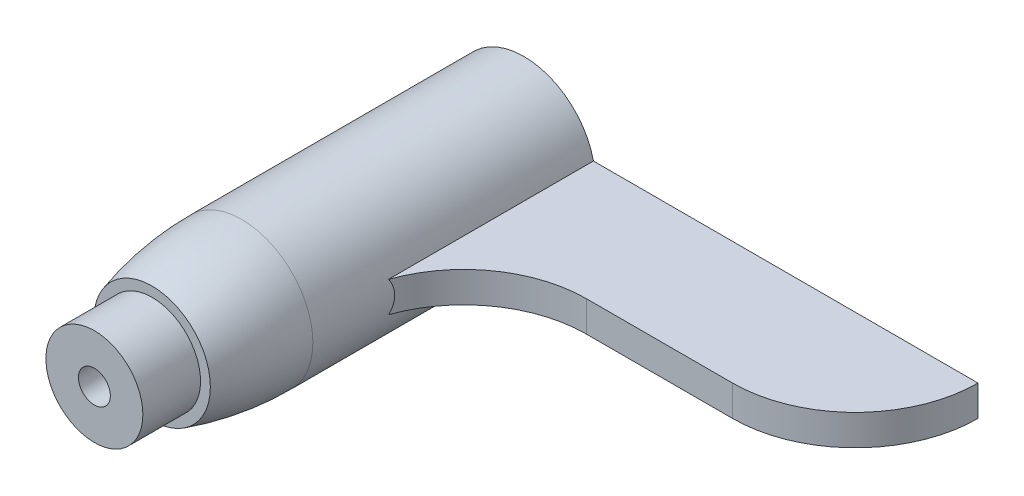
ISO-10303-21;
HEADER;
FILE_DESCRIPTION(('STEP AP214'),'2;1');
FILE_NAME('part.step','',(''),(''),'','','');
FILE_SCHEMA(('AUTOMOTIVE_DESIGN { 1 0 10303 214 1 1 1 1 }'));
ENDSEC;
DATA;
#1=APPLICATION_CONTEXT('core data for automotive mechanical design processes');
#2=APPLICATION_PROTOCOL_DEFINITION('international standard','automotive_design',2000,#1);
#3=PRODUCT_CONTEXT('',#1,'mechanical');
#4=PRODUCT('Part','Part','',(#3));
#5=PRODUCT_RELATED_PRODUCT_CATEGORY('part','',(#4));
#6=PRODUCT_DEFINITION_FORMATION('','',#4);
#7=PRODUCT_DEFINITION_CONTEXT('part definition',#1,'design');
#8=PRODUCT_DEFINITION('design','',#6,#7);
#9=PRODUCT_DEFINITION_SHAPE('','',#8);
#10=(LENGTH_UNIT() NAMED_UNIT(*) SI_UNIT(.MILLI.,.METRE.));
#11=(NAMED_UNIT(*) PLANE_ANGLE_UNIT() SI_UNIT($,.RADIAN.));
#12=(NAMED_UNIT(*) SI_UNIT($,.STERADIAN.) SOLID_ANGLE_UNIT());
#13=UNCERTAINTY_MEASURE_WITH_UNIT(LENGTH_MEASURE(1.E-05),#10,'distance_accuracy_value','');
#14=(GEOMETRIC_REPRESENTATION_CONTEXT(3) GLOBAL_UNCERTAINTY_ASSIGNED_CONTEXT((#13)) GLOBAL_UNIT_ASSIGNED_CONTEXT((#10,
#11,#12)) REPRESENTATION_CONTEXT('',''));
#15=CARTESIAN_POINT('',(0.,0.,0.));
#16=DIRECTION('',(0.,0.,1.));
#17=DIRECTION('',(1.,0.,0.));
#18=AXIS2_PLACEMENT_3D('',#15,#16,#17);
#19=CARTESIAN_POINT('',(0.,0.,23.));
#20=DIRECTION('',(0.,0.,-1.));
#21=DIRECTION('',(-1.,0.,0.));
#22=AXIS2_PLACEMENT_3D('',#19,#20,#21);
#23=CYLINDRICAL_SURFACE('',#22,5.8);
#24=CARTESIAN_POINT('',(0.,0.,23.));
#25=DIRECTION('',(0.,0.,1.));
#26=DIRECTION('',(1.,0.,0.));
#27=AXIS2_PLACEMENT_3D('',#24,#25,#26);
#28=CIRCLE('',#27,5.8);
#29=CARTESIAN_POINT('',(5.8,0.,23.));
#30=VERTEX_POINT('',#29);
#31=EDGE_CURVE('E45',#30,#30,#28,.T.);
#32=ORIENTED_EDGE('',*,*,#31,.F.);
#33=EDGE_LOOP('',(#32));
#34=FACE_BOUND('',#33,.T.);
#35=DIRECTION('',(0.,0.,-1.));
#36=VECTOR('',#35,1.);
#37=CARTESIAN_POINT('',(5.66370020393029,1.25,23.));
#38=LINE('',#37,#36);
#39=CARTESIAN_POINT('',(5.66370020393029,1.25,0.));
#40=VERTEX_POINT('',#39);
#41=CARTESIAN_POINT('',(5.66370020393029,1.25,16.6943581195537));
#42=VERTEX_POINT('',#41);
#43=EDGE_CURVE('E87',#40,#42,#38,.F.);
#44=ORIENTED_EDGE('',*,*,#43,.F.);
#45=CARTESIAN_POINT('',(0.,0.,0.));
#46=DIRECTION('',(0.,0.,1.));
#47=DIRECTION('',(1.,0.,0.));
#48=AXIS2_PLACEMENT_3D('',#45,#46,#47);
#49=CIRCLE('',#48,5.8);
#50=CARTESIAN_POINT('',(5.66370020393029,-1.25,0.));
#51=VERTEX_POINT('',#50);
#52=EDGE_CURVE('E123',#40,#51,#49,.T.);
#53=ORIENTED_EDGE('',*,*,#52,.T.);
#54=DIRECTION('',(0.,0.,-1.));
#55=VECTOR('',#54,1.);
#56=CARTESIAN_POINT('',(5.66370020393029,-1.25,23.));
#57=LINE('',#56,#55);
#58=CARTESIAN_POINT('',(5.66370020393029,-1.25,16.6943581195537));
#59=VERTEX_POINT('',#58);
#60=EDGE_CURVE('E96',#51,#59,#57,.F.);
#61=ORIENTED_EDGE('',*,*,#60,.T.);
#62=CARTESIAN_POINT('',(5.66370020393029,1.25,16.6943581195537));
#63=CARTESIAN_POINT('',(5.67527805384435,1.19754270115823,16.661302864782));
#64=CARTESIAN_POINT('',(5.68637662373565,1.1437859828789,16.6301716011866));
#65=CARTESIAN_POINT('',(5.70739227517795,1.03383434421869,16.5720223034653));
#66=CARTESIAN_POINT('',(5.71730870023423,0.977638092474154,16.5450065525639));
#67=CARTESIAN_POINT('',(5.74495451039579,0.805576723619499,16.4705204761731));
#68=CARTESIAN_POINT('',(5.76055018697844,0.68637173208329,16.429695806337));
#69=CARTESIAN_POINT('',(5.78445768861126,0.441809691570459,16.367756468644));
#70=CARTESIAN_POINT('',(5.79274453831036,0.316433081948017,16.346709367787));
#71=CARTESIAN_POINT('',(5.80102087765435,0.0638347290132216,16.3256881095753));
#72=CARTESIAN_POINT('',(5.80102493692735,-0.0633833807249769,16.3256769494961));
#73=CARTESIAN_POINT('',(5.79297169255558,-0.309811605845001,16.3461332331236));
#74=CARTESIAN_POINT('',(5.78529357690183,-0.429116918619726,16.3656374122334));
#75=CARTESIAN_POINT('',(5.7632047287075,-0.662756190260775,16.4227794964599));
#76=CARTESIAN_POINT('',(5.7487887700227,-0.777086214712757,16.4604314784575));
#77=CARTESIAN_POINT('',(5.72190068555743,-0.950778759641126,16.5325471938731));
#78=CARTESIAN_POINT('',(5.71122307619369,-1.0127828278463,16.5615181980528));
#79=CARTESIAN_POINT('',(5.6884515786713,-1.13370681953975,16.624356830675));
#80=CARTESIAN_POINT('',(5.67636278061071,-1.19263678211082,16.6582069580978));
#81=CARTESIAN_POINT('',(5.66370020393029,-1.25,16.6943581195537));
#82=B_SPLINE_CURVE_WITH_KNOTS('',3,(#62,#63,#64,#65,#66,#67,#68,#69,#70,#71,#72,#73,#74,#75,#76,
#77,#78,#79,#80,#81),.UNSPECIFIED.,.F.,.F.,(4,2,2,2,2,2,2,2,2,4),(0.,0.189141256322419,
0.37838706619023,0.757353867214392,1.1376106922534,1.51719863578914,1.87893121162049,
2.24094482871037,2.44851538325655,2.65535911767212),.UNSPECIFIED.);
#83=EDGE_CURVE('E11',#42,#59,#82,.T.);
#84=ORIENTED_EDGE('',*,*,#83,.F.);
#85=EDGE_LOOP('',(#44,#53,#61,#84));
#86=FACE_BOUND('',#85,.T.);
#87=ADVANCED_FACE('F33',(#34,#86),#23,.T.);
#88=CARTESIAN_POINT('',(0.,0.,0.));
#89=DIRECTION('',(0.,0.,1.));
#90=DIRECTION('',(1.,0.,0.));
#91=AXIS2_PLACEMENT_3D('',#88,#89,#90);
#92=PLANE('',#91);
#93=CARTESIAN_POINT('',(0.,0.,0.));
#94=DIRECTION('',(0.,0.,1.));
#95=DIRECTION('',(1.,0.,0.));
#96=AXIS2_PLACEMENT_3D('',#93,#94,#95);
#97=CIRCLE('',#96,1.3);
#98=CARTESIAN_POINT('',(1.3,0.,0.));
#99=VERTEX_POINT('',#98);
#100=EDGE_CURVE('E164',#99,#99,#97,.T.);
#101=ORIENTED_EDGE('',*,*,#100,.T.);
#102=EDGE_LOOP('',(#101));
#103=FACE_BOUND('',#102,.T.);
#104=ORIENTED_EDGE('',*,*,#52,.F.);
#105=DIRECTION('',(-1.,0.,0.));
#106=VECTOR('',#105,1.);
#107=CARTESIAN_POINT('',(0.,1.25,0.));
#108=LINE('',#107,#106);
#109=CARTESIAN_POINT('',(37.,1.25,0.));
#110=VERTEX_POINT('',#109);
#111=EDGE_CURVE('E59',#110,#40,#108,.T.);
#112=ORIENTED_EDGE('',*,*,#111,.F.);
#113=DIRECTION('',(0.,-1.,0.));
#114=VECTOR('',#113,1.);
#115=CARTESIAN_POINT('',(37.,1.25,0.));
#116=LINE('',#115,#114);
#117=CARTESIAN_POINT('',(37.,-1.25,0.));
#118=VERTEX_POINT('',#117);
#119=EDGE_CURVE('E108',#110,#118,#116,.T.);
#120=ORIENTED_EDGE('',*,*,#119,.T.);
#121=DIRECTION('',(-1.,0.,0.));
#122=VECTOR('',#121,1.);
#123=CARTESIAN_POINT('',(0.,-1.25,0.));
#124=LINE('',#123,#122);
#125=EDGE_CURVE('E90',#118,#51,#124,.T.);
#126=ORIENTED_EDGE('',*,*,#125,.T.);
#127=EDGE_LOOP('',(#104,#112,#120,#126));
#128=FACE_BOUND('',#127,.T.);
#129=ADVANCED_FACE('F129',(#103,#128),#92,.F.);
#130=CARTESIAN_POINT('',(15.1015353242447,1.25,20.));
#131=DIRECTION('',(0.,-1.,0.));
#132=DIRECTION('',(0.,0.,-1.));
#133=AXIS2_PLACEMENT_3D('',#130,#131,#132);
#134=CYLINDRICAL_SURFACE('',#133,10.);
#135=CARTESIAN_POINT('',(15.1015353242447,1.25,20.));
#136=DIRECTION('',(0.,-1.,0.));
#137=DIRECTION('',(0.,0.,1.));
#138=AXIS2_PLACEMENT_3D('',#135,#136,#137);
#139=CIRCLE('',#138,10.);
#140=CARTESIAN_POINT('',(15.1015353242447,1.25,10.));
#141=VERTEX_POINT('',#140);
#142=EDGE_CURVE('E81',#42,#141,#139,.T.);
#143=ORIENTED_EDGE('',*,*,#142,.F.);
#144=ORIENTED_EDGE('',*,*,#83,.T.);
#145=CARTESIAN_POINT('',(15.1015353242447,-1.25,20.));
#146=DIRECTION('',(0.,-1.,0.));
#147=DIRECTION('',(0.,0.,1.));
#148=AXIS2_PLACEMENT_3D('',#145,#146,#147);
#149=CIRCLE('',#148,10.);
#150=CARTESIAN_POINT('',(15.1015353242447,-1.25,10.));
#151=VERTEX_POINT('',#150);
#152=EDGE_CURVE('E52',#59,#151,#149,.T.);
#153=ORIENTED_EDGE('',*,*,#152,.T.);
#154=DIRECTION('',(0.,-1.,0.));
#155=VECTOR('',#154,1.);
#156=CARTESIAN_POINT('',(15.1015353242447,1.25,10.));
#157=LINE('',#156,#155);
#158=EDGE_CURVE('E93',#141,#151,#157,.T.);
#159=ORIENTED_EDGE('',*,*,#158,.F.);
#160=EDGE_LOOP('',(#143,#144,#153,#159));
#161=FACE_BOUND('',#160,.T.);
#162=ADVANCED_FACE('F94',(#161),#134,.F.);
#163=CARTESIAN_POINT('',(27.,1.25,0.));
#164=DIRECTION('',(0.,-1.,0.));
#165=DIRECTION('',(0.,0.,-1.));
#166=AXIS2_PLACEMENT_3D('',#163,#164,#165);
#167=PLANE('',#166);
#168=ORIENTED_EDGE('',*,*,#111,.T.);
#169=ORIENTED_EDGE('',*,*,#43,.T.);
#170=ORIENTED_EDGE('',*,*,#142,.T.);
#171=DIRECTION('',(1.,0.,0.));
#172=VECTOR('',#171,1.);
#173=CARTESIAN_POINT('',(27.,1.25,10.));
#174=LINE('',#173,#172);
#175=CARTESIAN_POINT('',(27.,1.25,10.));
#176=VERTEX_POINT('',#175);
#177=EDGE_CURVE('E85',#141,#176,#174,.T.);
#178=ORIENTED_EDGE('',*,*,#177,.T.);
#179=CARTESIAN_POINT('',(27.,1.25,0.));
#180=DIRECTION('',(0.,1.,0.));
#181=DIRECTION('',(0.,0.,-1.));
#182=AXIS2_PLACEMENT_3D('',#179,#180,#181);
#183=CIRCLE('',#182,10.);
#184=EDGE_CURVE('E102',#176,#110,#183,.T.);
#185=ORIENTED_EDGE('',*,*,#184,.T.);
#186=EDGE_LOOP('',(#168,#169,#170,#178,#185));
#187=FACE_BOUND('',#186,.T.);
#188=ADVANCED_FACE('F83',(#187),#167,.F.);
#189=CARTESIAN_POINT('',(27.,-1.25,0.));
#190=DIRECTION('',(0.,-1.,0.));
#191=DIRECTION('',(0.,0.,-1.));
#192=AXIS2_PLACEMENT_3D('',#189,#190,#191);
#193=PLANE('',#192);
#194=ORIENTED_EDGE('',*,*,#60,.F.);
#195=ORIENTED_EDGE('',*,*,#125,.F.);
#196=CARTESIAN_POINT('',(27.,-1.25,0.));
#197=DIRECTION('',(0.,1.,0.));
#198=DIRECTION('',(0.,0.,-1.));
#199=AXIS2_PLACEMENT_3D('',#196,#197,#198);
#200=CIRCLE('',#199,10.);
#201=CARTESIAN_POINT('',(27.,-1.25,10.));
#202=VERTEX_POINT('',#201);
#203=EDGE_CURVE('E113',#202,#118,#200,.T.);
#204=ORIENTED_EDGE('',*,*,#203,.F.);
#205=DIRECTION('',(1.,0.,0.));
#206=VECTOR('',#205,1.);
#207=CARTESIAN_POINT('',(27.,-1.25,10.));
#208=LINE('',#207,#206);
#209=EDGE_CURVE('E110',#151,#202,#208,.T.);
#210=ORIENTED_EDGE('',*,*,#209,.F.);
#211=ORIENTED_EDGE('',*,*,#152,.F.);
#212=EDGE_LOOP('',(#194,#195,#204,#210,#211));
#213=FACE_BOUND('',#212,.T.);
#214=ADVANCED_FACE('F133',(#213),#193,.T.);
#215=CARTESIAN_POINT('',(27.,1.25,10.));
#216=DIRECTION('',(0.,0.,-1.));
#217=DIRECTION('',(-1.,0.,0.));
#218=AXIS2_PLACEMENT_3D('',#215,#216,#217);
#219=PLANE('',#218);
#220=ORIENTED_EDGE('',*,*,#209,.T.);
#221=DIRECTION('',(0.,-1.,0.));
#222=VECTOR('',#221,1.);
#223=CARTESIAN_POINT('',(27.,1.25,10.));
#224=LINE('',#223,#222);
#225=EDGE_CURVE('E97',#176,#202,#224,.T.);
#226=ORIENTED_EDGE('',*,*,#225,.F.);
#227=ORIENTED_EDGE('',*,*,#177,.F.);
#228=ORIENTED_EDGE('',*,*,#158,.T.);
#229=EDGE_LOOP('',(#220,#226,#227,#228));
#230=FACE_BOUND('',#229,.T.);
#231=ADVANCED_FACE('F99',(#230),#219,.F.);
#232=CARTESIAN_POINT('',(27.,1.25,0.));
#233=DIRECTION('',(0.,-1.,0.));
#234=DIRECTION('',(0.,0.,-1.));
#235=AXIS2_PLACEMENT_3D('',#232,#233,#234);
#236=CYLINDRICAL_SURFACE('',#235,10.);
#237=ORIENTED_EDGE('',*,*,#203,.T.);
#238=ORIENTED_EDGE('',*,*,#119,.F.);
#239=ORIENTED_EDGE('',*,*,#184,.F.);
#240=ORIENTED_EDGE('',*,*,#225,.T.);
#241=EDGE_LOOP('',(#237,#238,#239,#240));
#242=FACE_BOUND('',#241,.T.);
#243=ADVANCED_FACE('F135',(#242),#236,.T.);
#244=CARTESIAN_POINT('',(0.,0.,23.0000000000001));
#245=DIRECTION('',(0.,0.,1.));
#246=DIRECTION('',(1.,0.,0.));
#247=AXIS2_PLACEMENT_3D('',#244,#245,#246);
#248=DEGENERATE_TOROIDAL_SURFACE('',#247,20.1011904761904,25.9011904761905,.F.);
#249=CARTESIAN_POINT('',(1.05791884566947E-13,0.,30.3));
#250=DIRECTION('',(0.,0.,1.));
#251=DIRECTION('',(1.,0.,0.));
#252=AXIS2_PLACEMENT_3D('',#249,#250,#251);
#253=CIRCLE('',#252,4.75000000000011);
#254=CARTESIAN_POINT('',(4.75000000000022,0.,30.3));
#255=VERTEX_POINT('',#254);
#256=EDGE_CURVE('E111',#255,#255,#253,.T.);
#257=ORIENTED_EDGE('',*,*,#256,.F.);
#258=EDGE_LOOP('',(#257));
#259=FACE_BOUND('',#258,.T.);
#260=ORIENTED_EDGE('',*,*,#31,.T.);
#261=EDGE_LOOP('',(#260));
#262=FACE_BOUND('',#261,.T.);
#263=ADVANCED_FACE('F137',(#259,#262),#248,.F.);
#264=CARTESIAN_POINT('',(-3.95,0.,30.3));
#265=DIRECTION('',(0.,0.,-1.));
#266=DIRECTION('',(-1.,0.,0.));
#267=AXIS2_PLACEMENT_3D('',#264,#265,#266);
#268=PLANE('',#267);
#269=CARTESIAN_POINT('',(1.05791884566947E-13,0.,30.3));
#270=DIRECTION('',(0.,0.,1.));
#271=DIRECTION('',(1.,0.,0.));
#272=AXIS2_PLACEMENT_3D('',#269,#270,#271);
#273=CIRCLE('',#272,3.95000000000011);
#274=CARTESIAN_POINT('',(3.95000000000021,0.,30.3));
#275=VERTEX_POINT('',#274);
#276=EDGE_CURVE('E170',#275,#275,#273,.T.);
#277=ORIENTED_EDGE('',*,*,#276,.F.);
#278=EDGE_LOOP('',(#277));
#279=FACE_BOUND('',#278,.T.);
#280=ORIENTED_EDGE('',*,*,#256,.T.);
#281=EDGE_LOOP('',(#280));
#282=FACE_BOUND('',#281,.T.);
#283=ADVANCED_FACE('F143',(#279,#282),#268,.F.);
#284=CARTESIAN_POINT('',(3.49148133884313E-12,0.,1000.));
#285=DIRECTION('',(0.,0.,1.));
#286=DIRECTION('',(1.,0.,0.));
#287=AXIS2_PLACEMENT_3D('',#284,#285,#286);
#288=CYLINDRICAL_SURFACE('',#287,3.95000000000011);
#289=CARTESIAN_POINT('',(1.2220184685951E-13,0.,35.));
#290=DIRECTION('',(0.,0.,1.));
#291=DIRECTION('',(1.,0.,0.));
#292=AXIS2_PLACEMENT_3D('',#289,#290,#291);
#293=CIRCLE('',#292,3.95000000000012);
#294=CARTESIAN_POINT('',(3.95000000000024,0.,35.));
#295=VERTEX_POINT('',#294);
#296=EDGE_CURVE('E166',#295,#295,#293,.T.);
#297=ORIENTED_EDGE('',*,*,#296,.F.);
#298=EDGE_LOOP('',(#297));
#299=FACE_BOUND('',#298,.T.);
#300=ORIENTED_EDGE('',*,*,#276,.T.);
#301=EDGE_LOOP('',(#300));
#302=FACE_BOUND('',#301,.T.);
#303=ADVANCED_FACE('F180',(#299,#302),#288,.T.);
#304=CARTESIAN_POINT('',(-3.95,0.,35.));
#305=DIRECTION('',(0.,0.,-1.));
#306=DIRECTION('',(-1.,0.,0.));
#307=AXIS2_PLACEMENT_3D('',#304,#305,#306);
#308=PLANE('',#307);
#309=CARTESIAN_POINT('',(0.,0.,35.));
#310=DIRECTION('',(0.,0.,1.));
#311=DIRECTION('',(1.,0.,0.));
#312=AXIS2_PLACEMENT_3D('',#309,#310,#311);
#313=CIRCLE('',#312,1.3);
#314=CARTESIAN_POINT('',(1.3,0.,35.));
#315=VERTEX_POINT('',#314);
#316=EDGE_CURVE('E167',#315,#315,#313,.T.);
#317=ORIENTED_EDGE('',*,*,#316,.F.);
#318=EDGE_LOOP('',(#317));
#319=FACE_BOUND('',#318,.T.);
#320=ORIENTED_EDGE('',*,*,#296,.T.);
#321=EDGE_LOOP('',(#320));
#322=FACE_BOUND('',#321,.T.);
#323=ADVANCED_FACE('F186',(#319,#322),#308,.F.);
#324=CARTESIAN_POINT('',(0.,0.,0.));
#325=DIRECTION('',(0.,0.,1.));
#326=DIRECTION('',(1.,0.,0.));
#327=AXIS2_PLACEMENT_3D('',#324,#325,#326);
#328=CYLINDRICAL_SURFACE('',#327,1.3);
#329=ORIENTED_EDGE('',*,*,#100,.F.);
#330=EDGE_LOOP('',(#329));
#331=FACE_BOUND('',#330,.T.);
#332=ORIENTED_EDGE('',*,*,#316,.T.);
#333=EDGE_LOOP('',(#332));
#334=FACE_BOUND('',#333,.T.);
#335=ADVANCED_FACE('F229',(#331,#334),#328,.F.);
#336=CLOSED_SHELL('',(#87,#129,#162,#188,#214,#231,#243,#263,#283,#303,#323,#335));
#337=MANIFOLD_SOLID_BREP('B2',#336);
#338=ADVANCED_BREP_SHAPE_REPRESENTATION('',(#18,#337),#14);
#339=SHAPE_DEFINITION_REPRESENTATION(#9,#338);
ENDSEC;
END-ISO-10303-21;
